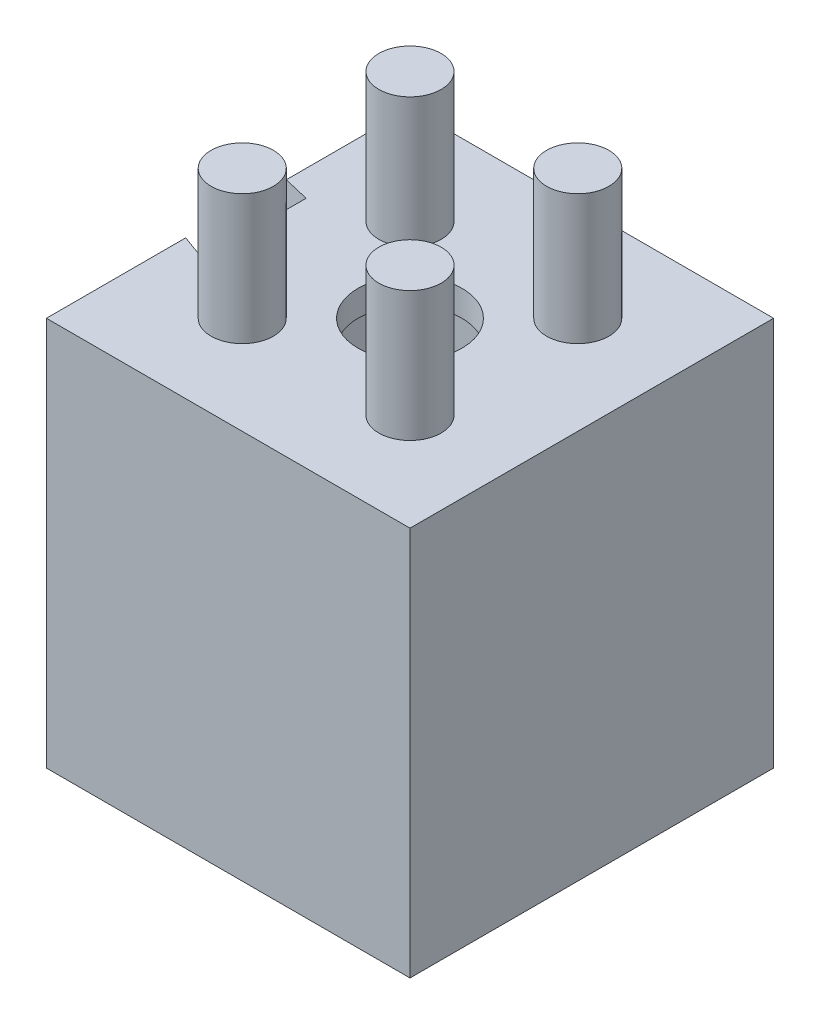
ISO-10303-21;
HEADER;
FILE_DESCRIPTION(('STEP AP214'),'2;1');
FILE_NAME('part.step','',(''),(''),'','','');
FILE_SCHEMA(('AUTOMOTIVE_DESIGN { 1 0 10303 214 1 1 1 1 }'));
ENDSEC;
DATA;
#1=APPLICATION_CONTEXT('core data for automotive mechanical design processes');
#2=APPLICATION_PROTOCOL_DEFINITION('international standard','automotive_design',2000,#1);
#3=PRODUCT_CONTEXT('',#1,'mechanical');
#4=PRODUCT('Part','Part','',(#3));
#5=PRODUCT_RELATED_PRODUCT_CATEGORY('part','',(#4));
#6=PRODUCT_DEFINITION_FORMATION('','',#4);
#7=PRODUCT_DEFINITION_CONTEXT('part definition',#1,'design');
#8=PRODUCT_DEFINITION('design','',#6,#7);
#9=PRODUCT_DEFINITION_SHAPE('','',#8);
#10=(LENGTH_UNIT() NAMED_UNIT(*) SI_UNIT(.MILLI.,.METRE.));
#11=(NAMED_UNIT(*) PLANE_ANGLE_UNIT() SI_UNIT($,.RADIAN.));
#12=(NAMED_UNIT(*) SI_UNIT($,.STERADIAN.) SOLID_ANGLE_UNIT());
#13=UNCERTAINTY_MEASURE_WITH_UNIT(LENGTH_MEASURE(1.E-05),#10,'distance_accuracy_value','');
#14=(GEOMETRIC_REPRESENTATION_CONTEXT(3) GLOBAL_UNCERTAINTY_ASSIGNED_CONTEXT((#13)) GLOBAL_UNIT_ASSIGNED_CONTEXT((#10,
#11,#12)) REPRESENTATION_CONTEXT('',''));
#15=CARTESIAN_POINT('',(0.,0.,0.));
#16=DIRECTION('',(0.,0.,1.));
#17=DIRECTION('',(1.,0.,0.));
#18=AXIS2_PLACEMENT_3D('',#15,#16,#17);
#19=CARTESIAN_POINT('',(0.,1.,0.));
#20=DIRECTION('',(0.,1.,0.));
#21=DIRECTION('',(0.,0.,1.));
#22=AXIS2_PLACEMENT_3D('',#19,#20,#21);
#23=PLANE('',#22);
#24=CARTESIAN_POINT('',(-9.12869624160349,1.,0.665876609059629));
#25=DIRECTION('',(0.,1.,0.));
#26=DIRECTION('',(0.,0.,-1.));
#27=AXIS2_PLACEMENT_3D('',#24,#25,#26);
#28=CIRCLE('',#27,1.2);
#29=CARTESIAN_POINT('',(-9.12869624160349,1.,-0.534123390940371));
#30=VERTEX_POINT('',#29);
#31=EDGE_CURVE('E629',#30,#30,#28,.T.);
#32=ORIENTED_EDGE('',*,*,#31,.F.);
#33=EDGE_LOOP('',(#32));
#34=FACE_BOUND('',#33,.T.);
#35=CARTESIAN_POINT('',(-2.66929752009454,1.,0.665876609059628));
#36=DIRECTION('',(0.,1.,0.));
#37=DIRECTION('',(0.,0.,1.));
#38=AXIS2_PLACEMENT_3D('',#35,#36,#37);
#39=CIRCLE('',#38,1.2);
#40=CARTESIAN_POINT('',(-2.66929752009454,1.,1.86587660905963));
#41=VERTEX_POINT('',#40);
#42=EDGE_CURVE('E636',#41,#41,#39,.T.);
#43=ORIENTED_EDGE('',*,*,#42,.F.);
#44=EDGE_LOOP('',(#43));
#45=FACE_BOUND('',#44,.T.);
#46=CARTESIAN_POINT('',(-2.66929752009454,1.,-5.79352211244933));
#47=DIRECTION('',(0.,1.,0.));
#48=DIRECTION('',(0.,0.,-1.));
#49=AXIS2_PLACEMENT_3D('',#46,#47,#48);
#50=CIRCLE('',#49,1.2);
#51=CARTESIAN_POINT('',(-2.66929752009454,1.,-6.99352211244933));
#52=VERTEX_POINT('',#51);
#53=EDGE_CURVE('E644',#52,#52,#50,.T.);
#54=ORIENTED_EDGE('',*,*,#53,.F.);
#55=EDGE_LOOP('',(#54));
#56=FACE_BOUND('',#55,.T.);
#57=CARTESIAN_POINT('',(-9.12869624160349,1.,-5.79352211244933));
#58=DIRECTION('',(0.,1.,0.));
#59=DIRECTION('',(0.,0.,1.));
#60=AXIS2_PLACEMENT_3D('',#57,#58,#59);
#61=CIRCLE('',#60,1.2);
#62=CARTESIAN_POINT('',(-9.12869624160349,1.,-4.59352211244933));
#63=VERTEX_POINT('',#62);
#64=EDGE_CURVE('E186',#63,#63,#61,.T.);
#65=ORIENTED_EDGE('',*,*,#64,.F.);
#66=EDGE_LOOP('',(#65));
#67=FACE_BOUND('',#66,.T.);
#68=DIRECTION('',(0.973024459449596,0.,0.23070197509519));
#69=VECTOR('',#68,1.);
#70=CARTESIAN_POINT('',(-12.898996880849,1.,-4.80092056856339));
#71=LINE('',#70,#69);
#72=CARTESIAN_POINT('',(-12.898996880849,1.,-4.80092056856339));
#73=VERTEX_POINT('',#72);
#74=CARTESIAN_POINT('',(-11.898996880849,1.,-4.56382275169485));
#75=VERTEX_POINT('',#74);
#76=EDGE_CURVE('E225',#73,#75,#71,.T.);
#77=ORIENTED_EDGE('',*,*,#76,.T.);
#78=DIRECTION('',(0.,0.,1.));
#79=VECTOR('',#78,1.);
#80=CARTESIAN_POINT('',(-11.898996880849,1.,-8.56382275169485));
#81=LINE('',#80,#79);
#82=CARTESIAN_POINT('',(-11.898996880849,1.,-0.563822751694851));
#83=VERTEX_POINT('',#82);
#84=EDGE_CURVE('E67',#75,#83,#81,.T.);
#85=ORIENTED_EDGE('',*,*,#84,.T.);
#86=DIRECTION('',(-0.939596341346136,0.,-0.342284553155641));
#87=VECTOR('',#86,1.);
#88=CARTESIAN_POINT('',(-12.898996880849,1.,-0.928111689501121));
#89=LINE('',#88,#87);
#90=CARTESIAN_POINT('',(-12.898996880849,1.,-0.928111689501121));
#91=VERTEX_POINT('',#90);
#92=EDGE_CURVE('E229',#83,#91,#89,.T.);
#93=ORIENTED_EDGE('',*,*,#92,.T.);
#94=DIRECTION('',(0.,0.,1.));
#95=VECTOR('',#94,1.);
#96=CARTESIAN_POINT('',(-12.898996880849,1.,4.43617724830515));
#97=LINE('',#96,#95);
#98=CARTESIAN_POINT('',(-12.898996880849,1.,4.43617724830515));
#99=VERTEX_POINT('',#98);
#100=EDGE_CURVE('E234',#91,#99,#97,.T.);
#101=ORIENTED_EDGE('',*,*,#100,.T.);
#102=DIRECTION('',(1.,0.,0.));
#103=VECTOR('',#102,1.);
#104=CARTESIAN_POINT('',(-12.898996880849,1.,4.43617724830515));
#105=LINE('',#104,#103);
#106=CARTESIAN_POINT('',(1.10100311915098,1.,4.43617724830515));
#107=VERTEX_POINT('',#106);
#108=EDGE_CURVE('E238',#99,#107,#105,.T.);
#109=ORIENTED_EDGE('',*,*,#108,.T.);
#110=DIRECTION('',(0.,0.,-1.));
#111=VECTOR('',#110,1.);
#112=CARTESIAN_POINT('',(1.10100311915098,1.,4.43617724830515));
#113=LINE('',#112,#111);
#114=CARTESIAN_POINT('',(1.10100311915098,1.,-9.56382275169485));
#115=VERTEX_POINT('',#114);
#116=EDGE_CURVE('E242',#107,#115,#113,.T.);
#117=ORIENTED_EDGE('',*,*,#116,.T.);
#118=DIRECTION('',(-1.,0.,0.));
#119=VECTOR('',#118,1.);
#120=CARTESIAN_POINT('',(1.10100311915098,1.,-9.56382275169485));
#121=LINE('',#120,#119);
#122=CARTESIAN_POINT('',(-12.898996880849,1.,-9.56382275169485));
#123=VERTEX_POINT('',#122);
#124=EDGE_CURVE('E183',#115,#123,#121,.T.);
#125=ORIENTED_EDGE('',*,*,#124,.T.);
#126=DIRECTION('',(0.,0.,1.));
#127=VECTOR('',#126,1.);
#128=CARTESIAN_POINT('',(-12.898996880849,1.,-9.56382275169485));
#129=LINE('',#128,#127);
#130=EDGE_CURVE('E179',#123,#73,#129,.T.);
#131=ORIENTED_EDGE('',*,*,#130,.T.);
#132=EDGE_LOOP('',(#77,#85,#93,#101,#109,#117,#125,#131));
#133=FACE_BOUND('',#132,.T.);
#134=CARTESIAN_POINT('',(-5.89899688084902,1.,-2.56382275169485));
#135=DIRECTION('',(0.,1.,0.));
#136=DIRECTION('',(0.,0.,1.));
#137=AXIS2_PLACEMENT_3D('',#134,#135,#136);
#138=CIRCLE('',#137,2.);
#139=CARTESIAN_POINT('',(-5.89899688084902,1.,-0.563822751694852));
#140=VERTEX_POINT('',#139);
#141=EDGE_CURVE('E289',#140,#140,#138,.T.);
#142=ORIENTED_EDGE('',*,*,#141,.F.);
#143=EDGE_LOOP('',(#142));
#144=FACE_BOUND('',#143,.T.);
#145=ADVANCED_FACE('F58',(#34,#45,#56,#67,#133,#144),#23,.T.);
#146=CARTESIAN_POINT('',(0.,0.,0.));
#147=DIRECTION('',(0.,1.,0.));
#148=DIRECTION('',(0.,0.,1.));
#149=AXIS2_PLACEMENT_3D('',#146,#147,#148);
#150=PLANE('',#149);
#151=DIRECTION('',(0.,0.,-1.));
#152=VECTOR('',#151,1.);
#153=CARTESIAN_POINT('',(0.101003119150982,0.,3.43617724830515));
#154=LINE('',#153,#152);
#155=CARTESIAN_POINT('',(0.101003119150982,0.,3.43617724830515));
#156=VERTEX_POINT('',#155);
#157=CARTESIAN_POINT('',(0.101003119150981,0.,-8.56382275169485));
#158=VERTEX_POINT('',#157);
#159=EDGE_CURVE('E293',#156,#158,#154,.T.);
#160=ORIENTED_EDGE('',*,*,#159,.F.);
#161=DIRECTION('',(1.,0.,0.));
#162=VECTOR('',#161,1.);
#163=CARTESIAN_POINT('',(-11.898996880849,0.,3.43617724830515));
#164=LINE('',#163,#162);
#165=CARTESIAN_POINT('',(-11.898996880849,0.,3.43617724830515));
#166=VERTEX_POINT('',#165);
#167=EDGE_CURVE('E300',#166,#156,#164,.T.);
#168=ORIENTED_EDGE('',*,*,#167,.F.);
#169=DIRECTION('',(0.,0.,-1.));
#170=VECTOR('',#169,1.);
#171=CARTESIAN_POINT('',(-11.898996880849,0.,0.));
#172=LINE('',#171,#170);
#173=CARTESIAN_POINT('',(-11.898996880849,0.,-0.563822751694851));
#174=VERTEX_POINT('',#173);
#175=EDGE_CURVE('E251',#166,#174,#172,.T.);
#176=ORIENTED_EDGE('',*,*,#175,.T.);
#177=DIRECTION('',(0.,0.,1.));
#178=VECTOR('',#177,1.);
#179=CARTESIAN_POINT('',(-11.898996880849,0.,-8.56382275169485));
#180=LINE('',#179,#178);
#181=CARTESIAN_POINT('',(-11.898996880849,0.,-4.56382275169485));
#182=VERTEX_POINT('',#181);
#183=EDGE_CURVE('E305',#182,#174,#180,.T.);
#184=ORIENTED_EDGE('',*,*,#183,.F.);
#185=CARTESIAN_POINT('',(-11.898996880849,0.,-8.56382275169485));
#186=VERTEX_POINT('',#185);
#187=EDGE_CURVE('E74',#186,#182,#180,.T.);
#188=ORIENTED_EDGE('',*,*,#187,.F.);
#189=DIRECTION('',(-1.,0.,0.));
#190=VECTOR('',#189,1.);
#191=CARTESIAN_POINT('',(0.101003119150981,0.,-8.56382275169485));
#192=LINE('',#191,#190);
#193=EDGE_CURVE('E82',#158,#186,#192,.T.);
#194=ORIENTED_EDGE('',*,*,#193,.F.);
#195=EDGE_LOOP('',(#160,#168,#176,#184,#188,#194));
#196=FACE_BOUND('',#195,.T.);
#197=CARTESIAN_POINT('',(-5.89899688084902,0.,-2.56382275169485));
#198=DIRECTION('',(0.,1.,0.));
#199=DIRECTION('',(0.,0.,1.));
#200=AXIS2_PLACEMENT_3D('',#197,#198,#199);
#201=CIRCLE('',#200,2.);
#202=CARTESIAN_POINT('',(-5.89899688084902,0.,-0.563822751694852));
#203=VERTEX_POINT('',#202);
#204=EDGE_CURVE('E288',#203,#203,#201,.T.);
#205=ORIENTED_EDGE('',*,*,#204,.T.);
#206=EDGE_LOOP('',(#205));
#207=FACE_BOUND('',#206,.T.);
#208=ADVANCED_FACE('F316',(#196,#207),#150,.F.);
#209=CARTESIAN_POINT('',(-11.898996880849,1.,-8.56382275169485));
#210=DIRECTION('',(1.,0.,0.));
#211=DIRECTION('',(0.,0.,-1.));
#212=AXIS2_PLACEMENT_3D('',#209,#210,#211);
#213=PLANE('',#212);
#214=ORIENTED_EDGE('',*,*,#84,.F.);
#215=DIRECTION('',(0.,-1.,0.));
#216=VECTOR('',#215,1.);
#217=CARTESIAN_POINT('',(-11.898996880849,1.,-4.56382275169485));
#218=LINE('',#217,#216);
#219=EDGE_CURVE('E12',#75,#182,#218,.T.);
#220=ORIENTED_EDGE('',*,*,#219,.T.);
#221=ORIENTED_EDGE('',*,*,#183,.T.);
#222=DIRECTION('',(0.,1.,0.));
#223=VECTOR('',#222,1.);
#224=CARTESIAN_POINT('',(-11.898996880849,-14.,-0.563822751694851));
#225=LINE('',#224,#223);
#226=EDGE_CURVE('E271',#174,#83,#225,.T.);
#227=ORIENTED_EDGE('',*,*,#226,.T.);
#228=EDGE_LOOP('',(#214,#220,#221,#227));
#229=FACE_BOUND('',#228,.T.);
#230=ADVANCED_FACE('F60',(#229),#213,.F.);
#231=CARTESIAN_POINT('',(-5.89899688084902,1.,-2.56382275169485));
#232=DIRECTION('',(0.,-1.,0.));
#233=DIRECTION('',(0.,0.,-1.));
#234=AXIS2_PLACEMENT_3D('',#231,#232,#233);
#235=CYLINDRICAL_SURFACE('',#234,2.);
#236=ORIENTED_EDGE('',*,*,#141,.T.);
#237=EDGE_LOOP('',(#236));
#238=FACE_BOUND('',#237,.T.);
#239=ORIENTED_EDGE('',*,*,#204,.F.);
#240=EDGE_LOOP('',(#239));
#241=FACE_BOUND('',#240,.T.);
#242=ADVANCED_FACE('F371',(#238,#241),#235,.F.);
#243=CARTESIAN_POINT('',(-11.898996880849,-14.,-4.56382275169485));
#244=DIRECTION('',(1.,0.,0.));
#245=DIRECTION('',(0.,0.,-1.));
#246=AXIS2_PLACEMENT_3D('',#243,#244,#245);
#247=PLANE('',#246);
#248=ORIENTED_EDGE('',*,*,#187,.T.);
#249=DIRECTION('',(0.,1.,0.));
#250=VECTOR('',#249,1.);
#251=CARTESIAN_POINT('',(-11.898996880849,-14.,-4.56382275169485));
#252=LINE('',#251,#250);
#253=CARTESIAN_POINT('',(-11.898996880849,-14.,-4.56382275169485));
#254=VERTEX_POINT('',#253);
#255=EDGE_CURVE('E153',#254,#182,#252,.T.);
#256=ORIENTED_EDGE('',*,*,#255,.F.);
#257=DIRECTION('',(0.,0.,-1.));
#258=VECTOR('',#257,1.);
#259=CARTESIAN_POINT('',(-11.898996880849,-14.,-4.56382275169485));
#260=LINE('',#259,#258);
#261=CARTESIAN_POINT('',(-11.898996880849,-14.,-8.56382275169485));
#262=VERTEX_POINT('',#261);
#263=EDGE_CURVE('E156',#254,#262,#260,.T.);
#264=ORIENTED_EDGE('',*,*,#263,.T.);
#265=DIRECTION('',(0.,1.,0.));
#266=VECTOR('',#265,1.);
#267=CARTESIAN_POINT('',(-11.898996880849,-14.,-8.56382275169485));
#268=LINE('',#267,#266);
#269=EDGE_CURVE('E160',#262,#186,#268,.T.);
#270=ORIENTED_EDGE('',*,*,#269,.T.);
#271=EDGE_LOOP('',(#248,#256,#264,#270));
#272=FACE_BOUND('',#271,.T.);
#273=ADVANCED_FACE('F155',(#272),#247,.T.);
#274=CARTESIAN_POINT('',(0.101003119150982,-14.,3.43617724830515));
#275=DIRECTION('',(0.,0.,-1.));
#276=DIRECTION('',(-1.,0.,0.));
#277=AXIS2_PLACEMENT_3D('',#274,#275,#276);
#278=PLANE('',#277);
#279=ORIENTED_EDGE('',*,*,#167,.T.);
#280=DIRECTION('',(0.,1.,0.));
#281=VECTOR('',#280,1.);
#282=CARTESIAN_POINT('',(0.101003119150982,-14.,3.43617724830515));
#283=LINE('',#282,#281);
#284=CARTESIAN_POINT('',(0.101003119150982,-14.,3.43617724830515));
#285=VERTEX_POINT('',#284);
#286=EDGE_CURVE('E276',#285,#156,#283,.T.);
#287=ORIENTED_EDGE('',*,*,#286,.F.);
#288=DIRECTION('',(-1.,0.,0.));
#289=VECTOR('',#288,1.);
#290=CARTESIAN_POINT('',(0.101003119150982,-14.,3.43617724830515));
#291=LINE('',#290,#289);
#292=CARTESIAN_POINT('',(-11.898996880849,-14.,3.43617724830515));
#293=VERTEX_POINT('',#292);
#294=EDGE_CURVE('E195',#285,#293,#291,.T.);
#295=ORIENTED_EDGE('',*,*,#294,.T.);
#296=DIRECTION('',(0.,1.,0.));
#297=VECTOR('',#296,1.);
#298=CARTESIAN_POINT('',(-11.898996880849,-14.,3.43617724830515));
#299=LINE('',#298,#297);
#300=EDGE_CURVE('E272',#293,#166,#299,.T.);
#301=ORIENTED_EDGE('',*,*,#300,.T.);
#302=EDGE_LOOP('',(#279,#287,#295,#301));
#303=FACE_BOUND('',#302,.T.);
#304=ADVANCED_FACE('F310',(#303),#278,.T.);
#305=CARTESIAN_POINT('',(-11.898996880849,-14.,-8.56382275169485));
#306=DIRECTION('',(0.,0.,1.));
#307=DIRECTION('',(1.,0.,0.));
#308=AXIS2_PLACEMENT_3D('',#305,#306,#307);
#309=PLANE('',#308);
#310=ORIENTED_EDGE('',*,*,#193,.T.);
#311=ORIENTED_EDGE('',*,*,#269,.F.);
#312=DIRECTION('',(1.,0.,0.));
#313=VECTOR('',#312,1.);
#314=CARTESIAN_POINT('',(-11.898996880849,-14.,-8.56382275169485));
#315=LINE('',#314,#313);
#316=CARTESIAN_POINT('',(0.101003119150981,-14.,-8.56382275169485));
#317=VERTEX_POINT('',#316);
#318=EDGE_CURVE('E172',#262,#317,#315,.T.);
#319=ORIENTED_EDGE('',*,*,#318,.T.);
#320=DIRECTION('',(0.,1.,0.));
#321=VECTOR('',#320,1.);
#322=CARTESIAN_POINT('',(0.101003119150981,-14.,-8.56382275169485));
#323=LINE('',#322,#321);
#324=EDGE_CURVE('E280',#317,#158,#323,.T.);
#325=ORIENTED_EDGE('',*,*,#324,.T.);
#326=EDGE_LOOP('',(#310,#311,#319,#325));
#327=FACE_BOUND('',#326,.T.);
#328=ADVANCED_FACE('F352',(#327),#309,.T.);
#329=CARTESIAN_POINT('',(-11.898996880849,-14.,3.43617724830515));
#330=DIRECTION('',(1.,0.,0.));
#331=DIRECTION('',(0.,0.,-1.));
#332=AXIS2_PLACEMENT_3D('',#329,#330,#331);
#333=PLANE('',#332);
#334=ORIENTED_EDGE('',*,*,#175,.F.);
#335=ORIENTED_EDGE('',*,*,#300,.F.);
#336=DIRECTION('',(0.,0.,-1.));
#337=VECTOR('',#336,1.);
#338=CARTESIAN_POINT('',(-11.898996880849,-14.,3.43617724830515));
#339=LINE('',#338,#337);
#340=CARTESIAN_POINT('',(-11.898996880849,-14.,-0.563822751694851));
#341=VERTEX_POINT('',#340);
#342=EDGE_CURVE('E199',#293,#341,#339,.T.);
#343=ORIENTED_EDGE('',*,*,#342,.T.);
#344=EDGE_CURVE('E267',#341,#174,#225,.T.);
#345=ORIENTED_EDGE('',*,*,#344,.T.);
#346=EDGE_LOOP('',(#334,#335,#343,#345));
#347=FACE_BOUND('',#346,.T.);
#348=ADVANCED_FACE('F350',(#347),#333,.T.);
#349=CARTESIAN_POINT('',(0.101003119150981,-14.,-8.56382275169485));
#350=DIRECTION('',(-1.,0.,0.));
#351=DIRECTION('',(0.,0.,1.));
#352=AXIS2_PLACEMENT_3D('',#349,#350,#351);
#353=PLANE('',#352);
#354=ORIENTED_EDGE('',*,*,#159,.T.);
#355=ORIENTED_EDGE('',*,*,#324,.F.);
#356=DIRECTION('',(0.,0.,1.));
#357=VECTOR('',#356,1.);
#358=CARTESIAN_POINT('',(0.101003119150981,-14.,-8.56382275169485));
#359=LINE('',#358,#357);
#360=EDGE_CURVE('E191',#317,#285,#359,.T.);
#361=ORIENTED_EDGE('',*,*,#360,.T.);
#362=ORIENTED_EDGE('',*,*,#286,.T.);
#363=EDGE_LOOP('',(#354,#355,#361,#362));
#364=FACE_BOUND('',#363,.T.);
#365=ADVANCED_FACE('F315',(#364),#353,.T.);
#366=CARTESIAN_POINT('',(-12.898996880849,-14.,-4.80092056856339));
#367=DIRECTION('',(-0.23070197509519,0.,0.973024459449596));
#368=DIRECTION('',(0.973024459449596,0.,0.23070197509519));
#369=AXIS2_PLACEMENT_3D('',#366,#367,#368);
#370=PLANE('',#369);
#371=ORIENTED_EDGE('',*,*,#76,.F.);
#372=DIRECTION('',(0.,1.,0.));
#373=VECTOR('',#372,1.);
#374=CARTESIAN_POINT('',(-12.898996880849,-14.,-4.80092056856339));
#375=LINE('',#374,#373);
#376=CARTESIAN_POINT('',(-12.898996880849,-14.,-4.80092056856339));
#377=VERTEX_POINT('',#376);
#378=EDGE_CURVE('E177',#377,#73,#375,.T.);
#379=ORIENTED_EDGE('',*,*,#378,.F.);
#380=DIRECTION('',(0.973024459449596,0.,0.23070197509519));
#381=VECTOR('',#380,1.);
#382=CARTESIAN_POINT('',(-12.898996880849,-14.,-4.80092056856339));
#383=LINE('',#382,#381);
#384=EDGE_CURVE('E168',#377,#254,#383,.T.);
#385=ORIENTED_EDGE('',*,*,#384,.T.);
#386=ORIENTED_EDGE('',*,*,#255,.T.);
#387=ORIENTED_EDGE('',*,*,#219,.F.);
#388=EDGE_LOOP('',(#371,#379,#385,#386,#387));
#389=FACE_BOUND('',#388,.T.);
#390=ADVANCED_FACE('F176',(#389),#370,.T.);
#391=CARTESIAN_POINT('',(-12.898996880849,-14.,-9.56382275169485));
#392=DIRECTION('',(-1.,0.,0.));
#393=DIRECTION('',(0.,0.,1.));
#394=AXIS2_PLACEMENT_3D('',#391,#392,#393);
#395=PLANE('',#394);
#396=ORIENTED_EDGE('',*,*,#130,.F.);
#397=DIRECTION('',(0.,1.,0.));
#398=VECTOR('',#397,1.);
#399=CARTESIAN_POINT('',(-12.898996880849,-14.,-9.56382275169485));
#400=LINE('',#399,#398);
#401=CARTESIAN_POINT('',(-12.898996880849,-14.,-9.56382275169485));
#402=VERTEX_POINT('',#401);
#403=EDGE_CURVE('E252',#402,#123,#400,.T.);
#404=ORIENTED_EDGE('',*,*,#403,.F.);
#405=DIRECTION('',(0.,0.,1.));
#406=VECTOR('',#405,1.);
#407=CARTESIAN_POINT('',(-12.898996880849,-14.,-9.56382275169485));
#408=LINE('',#407,#406);
#409=EDGE_CURVE('E161',#402,#377,#408,.T.);
#410=ORIENTED_EDGE('',*,*,#409,.T.);
#411=ORIENTED_EDGE('',*,*,#378,.T.);
#412=EDGE_LOOP('',(#396,#404,#410,#411));
#413=FACE_BOUND('',#412,.T.);
#414=ADVANCED_FACE('F331',(#413),#395,.T.);
#415=CARTESIAN_POINT('',(1.10100311915098,-14.,-9.56382275169485));
#416=DIRECTION('',(0.,0.,-1.));
#417=DIRECTION('',(-1.,0.,0.));
#418=AXIS2_PLACEMENT_3D('',#415,#416,#417);
#419=PLANE('',#418);
#420=ORIENTED_EDGE('',*,*,#124,.F.);
#421=DIRECTION('',(0.,1.,0.));
#422=VECTOR('',#421,1.);
#423=CARTESIAN_POINT('',(1.10100311915098,-14.,-9.56382275169485));
#424=LINE('',#423,#422);
#425=CARTESIAN_POINT('',(1.10100311915098,-14.,-9.56382275169485));
#426=VERTEX_POINT('',#425);
#427=EDGE_CURVE('E255',#426,#115,#424,.T.);
#428=ORIENTED_EDGE('',*,*,#427,.F.);
#429=DIRECTION('',(-1.,0.,0.));
#430=VECTOR('',#429,1.);
#431=CARTESIAN_POINT('',(1.10100311915098,-14.,-9.56382275169485));
#432=LINE('',#431,#430);
#433=EDGE_CURVE('E219',#426,#402,#432,.T.);
#434=ORIENTED_EDGE('',*,*,#433,.T.);
#435=ORIENTED_EDGE('',*,*,#403,.T.);
#436=EDGE_LOOP('',(#420,#428,#434,#435));
#437=FACE_BOUND('',#436,.T.);
#438=ADVANCED_FACE('F416',(#437),#419,.T.);
#439=CARTESIAN_POINT('',(1.10100311915098,-14.,4.43617724830515));
#440=DIRECTION('',(1.,0.,0.));
#441=DIRECTION('',(0.,0.,-1.));
#442=AXIS2_PLACEMENT_3D('',#439,#440,#441);
#443=PLANE('',#442);
#444=ORIENTED_EDGE('',*,*,#116,.F.);
#445=DIRECTION('',(0.,1.,0.));
#446=VECTOR('',#445,1.);
#447=CARTESIAN_POINT('',(1.10100311915098,-14.,4.43617724830515));
#448=LINE('',#447,#446);
#449=CARTESIAN_POINT('',(1.10100311915098,-14.,4.43617724830515));
#450=VERTEX_POINT('',#449);
#451=EDGE_CURVE('E258',#450,#107,#448,.T.);
#452=ORIENTED_EDGE('',*,*,#451,.F.);
#453=DIRECTION('',(0.,0.,-1.));
#454=VECTOR('',#453,1.);
#455=CARTESIAN_POINT('',(1.10100311915098,-14.,4.43617724830515));
#456=LINE('',#455,#454);
#457=EDGE_CURVE('E215',#450,#426,#456,.T.);
#458=ORIENTED_EDGE('',*,*,#457,.T.);
#459=ORIENTED_EDGE('',*,*,#427,.T.);
#460=EDGE_LOOP('',(#444,#452,#458,#459));
#461=FACE_BOUND('',#460,.T.);
#462=ADVANCED_FACE('F338',(#461),#443,.T.);
#463=CARTESIAN_POINT('',(-12.898996880849,-14.,4.43617724830515));
#464=DIRECTION('',(0.,0.,1.));
#465=DIRECTION('',(1.,0.,0.));
#466=AXIS2_PLACEMENT_3D('',#463,#464,#465);
#467=PLANE('',#466);
#468=ORIENTED_EDGE('',*,*,#108,.F.);
#469=DIRECTION('',(0.,1.,0.));
#470=VECTOR('',#469,1.);
#471=CARTESIAN_POINT('',(-12.898996880849,-14.,4.43617724830515));
#472=LINE('',#471,#470);
#473=CARTESIAN_POINT('',(-12.898996880849,-14.,4.43617724830515));
#474=VERTEX_POINT('',#473);
#475=EDGE_CURVE('E261',#474,#99,#472,.T.);
#476=ORIENTED_EDGE('',*,*,#475,.F.);
#477=DIRECTION('',(1.,0.,0.));
#478=VECTOR('',#477,1.);
#479=CARTESIAN_POINT('',(-12.898996880849,-14.,4.43617724830515));
#480=LINE('',#479,#478);
#481=EDGE_CURVE('E211',#474,#450,#480,.T.);
#482=ORIENTED_EDGE('',*,*,#481,.T.);
#483=ORIENTED_EDGE('',*,*,#451,.T.);
#484=EDGE_LOOP('',(#468,#476,#482,#483));
#485=FACE_BOUND('',#484,.T.);
#486=ADVANCED_FACE('F341',(#485),#467,.T.);
#487=CARTESIAN_POINT('',(-12.898996880849,-14.,4.43617724830515));
#488=DIRECTION('',(-1.,0.,0.));
#489=DIRECTION('',(0.,0.,1.));
#490=AXIS2_PLACEMENT_3D('',#487,#488,#489);
#491=PLANE('',#490);
#492=ORIENTED_EDGE('',*,*,#100,.F.);
#493=DIRECTION('',(0.,1.,0.));
#494=VECTOR('',#493,1.);
#495=CARTESIAN_POINT('',(-12.898996880849,-14.,-0.928111689501121));
#496=LINE('',#495,#494);
#497=CARTESIAN_POINT('',(-12.898996880849,-14.,-0.928111689501121));
#498=VERTEX_POINT('',#497);
#499=EDGE_CURVE('E264',#498,#91,#496,.T.);
#500=ORIENTED_EDGE('',*,*,#499,.F.);
#501=DIRECTION('',(0.,0.,1.));
#502=VECTOR('',#501,1.);
#503=CARTESIAN_POINT('',(-12.898996880849,-14.,4.43617724830515));
#504=LINE('',#503,#502);
#505=EDGE_CURVE('E207',#498,#474,#504,.T.);
#506=ORIENTED_EDGE('',*,*,#505,.T.);
#507=ORIENTED_EDGE('',*,*,#475,.T.);
#508=EDGE_LOOP('',(#492,#500,#506,#507));
#509=FACE_BOUND('',#508,.T.);
#510=ADVANCED_FACE('F346',(#509),#491,.T.);
#511=CARTESIAN_POINT('',(-12.898996880849,-14.,-0.928111689501121));
#512=DIRECTION('',(0.342284553155641,0.,-0.939596341346135));
#513=DIRECTION('',(-0.939596341346135,0.,-0.342284553155641));
#514=AXIS2_PLACEMENT_3D('',#511,#512,#513);
#515=PLANE('',#514);
#516=ORIENTED_EDGE('',*,*,#92,.F.);
#517=ORIENTED_EDGE('',*,*,#226,.F.);
#518=ORIENTED_EDGE('',*,*,#344,.F.);
#519=DIRECTION('',(-0.939596341346136,0.,-0.342284553155641));
#520=VECTOR('',#519,1.);
#521=CARTESIAN_POINT('',(-12.898996880849,-14.,-0.928111689501121));
#522=LINE('',#521,#520);
#523=EDGE_CURVE('E203',#341,#498,#522,.T.);
#524=ORIENTED_EDGE('',*,*,#523,.T.);
#525=ORIENTED_EDGE('',*,*,#499,.T.);
#526=EDGE_LOOP('',(#516,#517,#518,#524,#525));
#527=FACE_BOUND('',#526,.T.);
#528=ADVANCED_FACE('F347',(#527),#515,.T.);
#529=CARTESIAN_POINT('',(0.,-14.,0.));
#530=DIRECTION('',(0.,1.,0.));
#531=DIRECTION('',(0.,0.,1.));
#532=AXIS2_PLACEMENT_3D('',#529,#530,#531);
#533=PLANE('',#532);
#534=ORIENTED_EDGE('',*,*,#384,.F.);
#535=ORIENTED_EDGE('',*,*,#409,.F.);
#536=ORIENTED_EDGE('',*,*,#433,.F.);
#537=ORIENTED_EDGE('',*,*,#457,.F.);
#538=ORIENTED_EDGE('',*,*,#481,.F.);
#539=ORIENTED_EDGE('',*,*,#505,.F.);
#540=ORIENTED_EDGE('',*,*,#523,.F.);
#541=ORIENTED_EDGE('',*,*,#342,.F.);
#542=ORIENTED_EDGE('',*,*,#294,.F.);
#543=ORIENTED_EDGE('',*,*,#360,.F.);
#544=ORIENTED_EDGE('',*,*,#318,.F.);
#545=ORIENTED_EDGE('',*,*,#263,.F.);
#546=EDGE_LOOP('',(#534,#535,#536,#537,#538,#539,#540,#541,#542,#543,#544,#545));
#547=FACE_BOUND('',#546,.T.);
#548=ADVANCED_FACE('F166',(#547),#533,.F.);
#549=CARTESIAN_POINT('',(-9.12869624160349,6.,-5.79352211244933));
#550=DIRECTION('',(0.,-1.,0.));
#551=DIRECTION('',(0.,0.,-1.));
#552=AXIS2_PLACEMENT_3D('',#549,#550,#551);
#553=CYLINDRICAL_SURFACE('',#552,1.2);
#554=CARTESIAN_POINT('',(-9.12869624160349,6.,-5.79352211244933));
#555=DIRECTION('',(0.,1.,0.));
#556=DIRECTION('',(0.,0.,1.));
#557=AXIS2_PLACEMENT_3D('',#554,#555,#556);
#558=CIRCLE('',#557,1.2);
#559=CARTESIAN_POINT('',(-9.12869624160349,6.,-4.59352211244933));
#560=VERTEX_POINT('',#559);
#561=EDGE_CURVE('E230',#560,#560,#558,.T.);
#562=ORIENTED_EDGE('',*,*,#561,.F.);
#563=EDGE_LOOP('',(#562));
#564=FACE_BOUND('',#563,.T.);
#565=ORIENTED_EDGE('',*,*,#64,.T.);
#566=EDGE_LOOP('',(#565));
#567=FACE_BOUND('',#566,.T.);
#568=ADVANCED_FACE('F469',(#564,#567),#553,.T.);
#569=CARTESIAN_POINT('',(-9.12869624160349,6.,-5.79352211244933));
#570=DIRECTION('',(0.,1.,0.));
#571=DIRECTION('',(0.,0.,1.));
#572=AXIS2_PLACEMENT_3D('',#569,#570,#571);
#573=PLANE('',#572);
#574=ORIENTED_EDGE('',*,*,#561,.T.);
#575=EDGE_LOOP('',(#574));
#576=FACE_BOUND('',#575,.T.);
#577=ADVANCED_FACE('F487',(#576),#573,.T.);
#578=CARTESIAN_POINT('',(-2.66929752009454,6.,-5.79352211244933));
#579=DIRECTION('',(0.,-1.,0.));
#580=DIRECTION('',(0.,0.,-1.));
#581=AXIS2_PLACEMENT_3D('',#578,#579,#580);
#582=CYLINDRICAL_SURFACE('',#581,1.2);
#583=CARTESIAN_POINT('',(-2.66929752009454,6.,-5.79352211244933));
#584=DIRECTION('',(0.,1.,0.));
#585=DIRECTION('',(0.,0.,-1.));
#586=AXIS2_PLACEMENT_3D('',#583,#584,#585);
#587=CIRCLE('',#586,1.2);
#588=CARTESIAN_POINT('',(-2.66929752009454,6.,-6.99352211244933));
#589=VERTEX_POINT('',#588);
#590=EDGE_CURVE('E640',#589,#589,#587,.T.);
#591=ORIENTED_EDGE('',*,*,#590,.F.);
#592=EDGE_LOOP('',(#591));
#593=FACE_BOUND('',#592,.T.);
#594=ORIENTED_EDGE('',*,*,#53,.T.);
#595=EDGE_LOOP('',(#594));
#596=FACE_BOUND('',#595,.T.);
#597=ADVANCED_FACE('F498',(#593,#596),#582,.T.);
#598=CARTESIAN_POINT('',(-2.66929752009454,6.,-5.79352211244933));
#599=DIRECTION('',(0.,-1.,0.));
#600=DIRECTION('',(0.,0.,-1.));
#601=AXIS2_PLACEMENT_3D('',#598,#599,#600);
#602=PLANE('',#601);
#603=ORIENTED_EDGE('',*,*,#590,.T.);
#604=EDGE_LOOP('',(#603));
#605=FACE_BOUND('',#604,.T.);
#606=ADVANCED_FACE('F509',(#605),#602,.F.);
#607=CARTESIAN_POINT('',(-2.66929752009454,6.,0.665876609059628));
#608=DIRECTION('',(0.,-1.,0.));
#609=DIRECTION('',(0.,0.,-1.));
#610=AXIS2_PLACEMENT_3D('',#607,#608,#609);
#611=CYLINDRICAL_SURFACE('',#610,1.2);
#612=CARTESIAN_POINT('',(-2.66929752009454,6.,0.665876609059628));
#613=DIRECTION('',(0.,1.,0.));
#614=DIRECTION('',(0.,0.,1.));
#615=AXIS2_PLACEMENT_3D('',#612,#613,#614);
#616=CIRCLE('',#615,1.2);
#617=CARTESIAN_POINT('',(-2.66929752009454,6.,1.86587660905963));
#618=VERTEX_POINT('',#617);
#619=EDGE_CURVE('E633',#618,#618,#616,.T.);
#620=ORIENTED_EDGE('',*,*,#619,.F.);
#621=EDGE_LOOP('',(#620));
#622=FACE_BOUND('',#621,.T.);
#623=ORIENTED_EDGE('',*,*,#42,.T.);
#624=EDGE_LOOP('',(#623));
#625=FACE_BOUND('',#624,.T.);
#626=ADVANCED_FACE('F520',(#622,#625),#611,.T.);
#627=CARTESIAN_POINT('',(-2.66929752009454,6.,0.665876609059628));
#628=DIRECTION('',(0.,1.,0.));
#629=DIRECTION('',(0.,0.,1.));
#630=AXIS2_PLACEMENT_3D('',#627,#628,#629);
#631=PLANE('',#630);
#632=ORIENTED_EDGE('',*,*,#619,.T.);
#633=EDGE_LOOP('',(#632));
#634=FACE_BOUND('',#633,.T.);
#635=ADVANCED_FACE('F531',(#634),#631,.T.);
#636=CARTESIAN_POINT('',(-9.12869624160349,6.,0.665876609059629));
#637=DIRECTION('',(0.,-1.,0.));
#638=DIRECTION('',(0.,0.,-1.));
#639=AXIS2_PLACEMENT_3D('',#636,#637,#638);
#640=CYLINDRICAL_SURFACE('',#639,1.2);
#641=CARTESIAN_POINT('',(-9.12869624160349,6.,0.665876609059629));
#642=DIRECTION('',(0.,1.,0.));
#643=DIRECTION('',(0.,0.,-1.));
#644=AXIS2_PLACEMENT_3D('',#641,#642,#643);
#645=CIRCLE('',#644,1.2);
#646=CARTESIAN_POINT('',(-9.12869624160349,6.,-0.534123390940371));
#647=VERTEX_POINT('',#646);
#648=EDGE_CURVE('E627',#647,#647,#645,.T.);
#649=ORIENTED_EDGE('',*,*,#648,.F.);
#650=EDGE_LOOP('',(#649));
#651=FACE_BOUND('',#650,.T.);
#652=ORIENTED_EDGE('',*,*,#31,.T.);
#653=EDGE_LOOP('',(#652));
#654=FACE_BOUND('',#653,.T.);
#655=ADVANCED_FACE('F542',(#651,#654),#640,.T.);
#656=CARTESIAN_POINT('',(-9.12869624160349,6.,0.665876609059629));
#657=DIRECTION('',(0.,-1.,0.));
#658=DIRECTION('',(0.,0.,-1.));
#659=AXIS2_PLACEMENT_3D('',#656,#657,#658);
#660=PLANE('',#659);
#661=ORIENTED_EDGE('',*,*,#648,.T.);
#662=EDGE_LOOP('',(#661));
#663=FACE_BOUND('',#662,.T.);
#664=ADVANCED_FACE('F553',(#663),#660,.F.);
#665=CLOSED_SHELL('',(#145,#208,#230,#242,#273,#304,#328,#348,#365,#390,#414,#438,#462,#486,
#510,#528,#548,#568,#577,#597,#606,#626,#635,#655,#664));
#666=MANIFOLD_SOLID_BREP('B2',#665);
#667=ADVANCED_BREP_SHAPE_REPRESENTATION('',(#18,#666),#14);
#668=SHAPE_DEFINITION_REPRESENTATION(#9,#667);
ENDSEC;
END-ISO-10303-21;
